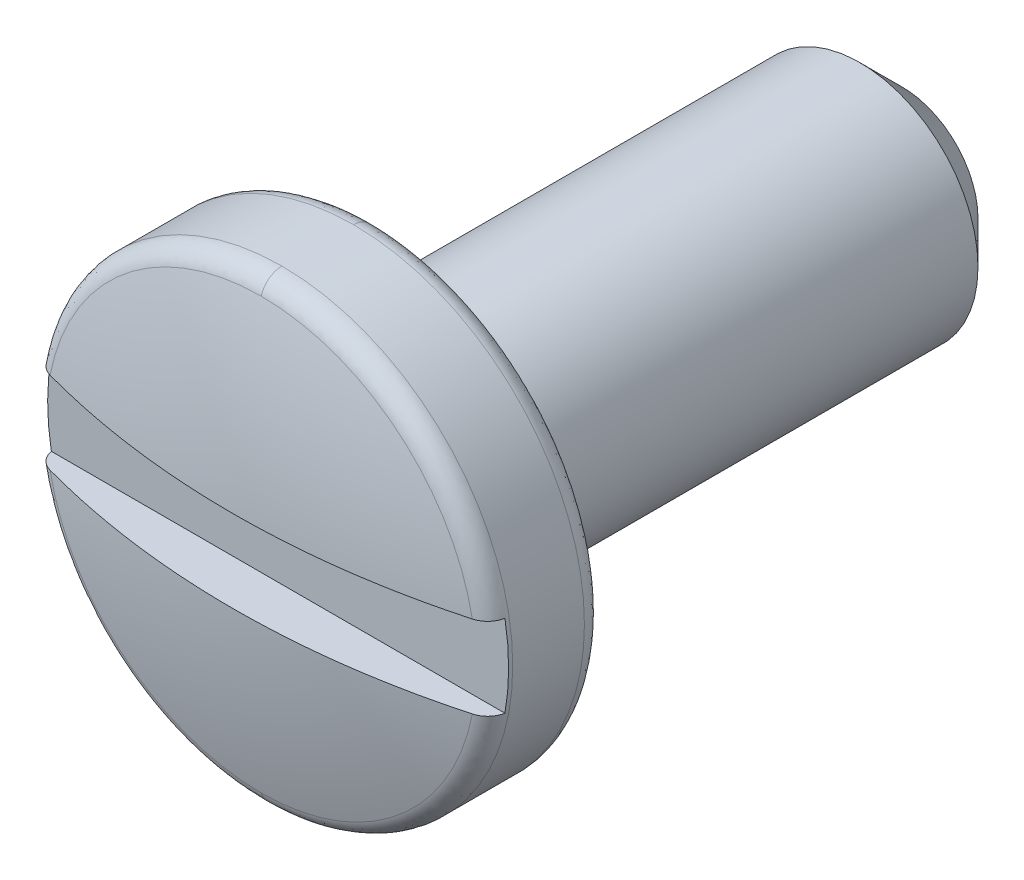
ISO-10303-21;
HEADER;
FILE_DESCRIPTION(('STEP AP214'),'2;1');
FILE_NAME('part.step','',(''),(''),'','','');
FILE_SCHEMA(('AUTOMOTIVE_DESIGN { 1 0 10303 214 1 1 1 1 }'));
ENDSEC;
DATA;
#1=APPLICATION_CONTEXT('core data for automotive mechanical design processes');
#2=APPLICATION_PROTOCOL_DEFINITION('international standard','automotive_design',2000,#1);
#3=PRODUCT_CONTEXT('',#1,'mechanical');
#4=PRODUCT('Part','Part','',(#3));
#5=PRODUCT_RELATED_PRODUCT_CATEGORY('part','',(#4));
#6=PRODUCT_DEFINITION_FORMATION('','',#4);
#7=PRODUCT_DEFINITION_CONTEXT('part definition',#1,'design');
#8=PRODUCT_DEFINITION('design','',#6,#7);
#9=PRODUCT_DEFINITION_SHAPE('','',#8);
#10=(LENGTH_UNIT() NAMED_UNIT(*) SI_UNIT(.MILLI.,.METRE.));
#11=(NAMED_UNIT(*) PLANE_ANGLE_UNIT() SI_UNIT($,.RADIAN.));
#12=(NAMED_UNIT(*) SI_UNIT($,.STERADIAN.) SOLID_ANGLE_UNIT());
#13=UNCERTAINTY_MEASURE_WITH_UNIT(LENGTH_MEASURE(1.E-05),#10,'distance_accuracy_value','');
#14=(GEOMETRIC_REPRESENTATION_CONTEXT(3) GLOBAL_UNCERTAINTY_ASSIGNED_CONTEXT((#13)) GLOBAL_UNIT_ASSIGNED_CONTEXT((#10,
#11,#12)) REPRESENTATION_CONTEXT('',''));
#15=CARTESIAN_POINT('',(0.,0.,0.));
#16=DIRECTION('',(0.,0.,1.));
#17=DIRECTION('',(1.,0.,0.));
#18=AXIS2_PLACEMENT_3D('',#15,#16,#17);
#19=CARTESIAN_POINT('',(2.810560784,-0.4953,7.5184));
#20=DIRECTION('',(0.,0.,-1.));
#21=DIRECTION('',(-1.,0.,0.));
#22=AXIS2_PLACEMENT_3D('',#19,#20,#21);
#23=PLANE('',#22);
#24=DIRECTION('',(1.,0.,0.));
#25=VECTOR('',#24,1.);
#26=CARTESIAN_POINT('',(0.,0.4953,7.5184));
#27=LINE('',#26,#25);
#28=CARTESIAN_POINT('',(-2.7327104607907,0.49530000058965,7.5184));
#29=VERTEX_POINT('',#28);
#30=CARTESIAN_POINT('',(2.73271046156647,0.495300000589655,7.5184000000816));
#31=VERTEX_POINT('',#30);
#32=EDGE_CURVE('E91',#29,#31,#27,.T.);
#33=ORIENTED_EDGE('',*,*,#32,.F.);
#34=CARTESIAN_POINT('',(-2.73271046147436,-0.4953000011793,7.5184));
#35=CARTESIAN_POINT('',(-2.74828039738149,-0.409469193814245,7.5184));
#36=CARTESIAN_POINT('',(-2.75978135809512,-0.322899123500108,7.5184));
#37=CARTESIAN_POINT('',(-2.77453736354793,-0.149786146779268,7.5184));
#38=CARTESIAN_POINT('',(-2.77786034483515,-0.0632490292027887,7.5184));
#39=CARTESIAN_POINT('',(-2.7764772397923,0.102066373689573,7.5184));
#40=CARTESIAN_POINT('',(-2.77245807880627,0.180851109326066,7.5184));
#41=CARTESIAN_POINT('',(-2.75768636332443,0.33839564789017,7.5184));
#42=CARTESIAN_POINT('',(-2.74688248153751,0.417150639801147,7.5184));
#43=CARTESIAN_POINT('',(-2.73271046147437,0.495300001179283,7.5184));
#44=B_SPLINE_CURVE_WITH_KNOTS('',3,(#34,#35,#36,#37,#38,#39,#40,#41,#42,#43),.UNSPECIFIED.,.F.,
.F.,(4,2,2,2,4),(0.,0.261601847042544,0.52102305314427,0.757402518901725,0.995592131386147),.UNSPECIFIED.);
#45=CARTESIAN_POINT('',(-2.73271046156637,-0.49530000058965,7.51840000008158));
#46=VERTEX_POINT('',#45);
#47=EDGE_CURVE('E21',#46,#29,#44,.T.);
#48=ORIENTED_EDGE('',*,*,#47,.F.);
#49=DIRECTION('',(1.,0.,0.));
#50=VECTOR('',#49,1.);
#51=CARTESIAN_POINT('',(0.,-0.4953,7.5184));
#52=LINE('',#51,#50);
#53=CARTESIAN_POINT('',(2.73271046079075,-0.495300000589654,7.5184));
#54=VERTEX_POINT('',#53);
#55=EDGE_CURVE('E88',#46,#54,#52,.T.);
#56=ORIENTED_EDGE('',*,*,#55,.T.);
#57=CARTESIAN_POINT('',(2.73271046147447,0.495300001179309,7.5184));
#58=CARTESIAN_POINT('',(2.74828039738158,0.409469193814328,7.5184));
#59=CARTESIAN_POINT('',(2.7597813580952,0.322899123500266,7.5184));
#60=CARTESIAN_POINT('',(2.77453736354801,0.149786146779574,7.5184));
#61=CARTESIAN_POINT('',(2.77786034483524,0.0632490292031695,7.5184));
#62=CARTESIAN_POINT('',(2.77647723979242,-0.102066373689196,7.5184));
#63=CARTESIAN_POINT('',(2.7724580788064,-0.180851109325765,7.5184));
#64=CARTESIAN_POINT('',(2.75768636332455,-0.338395647890023,7.5184));
#65=CARTESIAN_POINT('',(2.74688248153763,-0.417150639801077,7.5184));
#66=CARTESIAN_POINT('',(2.73271046147447,-0.495300001179289,7.5184));
#67=B_SPLINE_CURVE_WITH_KNOTS('',3,(#57,#58,#59,#60,#61,#62,#63,#64,#65,#66),.UNSPECIFIED.,.F.,
.F.,(4,2,2,2,4),(0.,0.26160184704232,0.521023053143826,0.75740251890151,0.995592131386164),.UNSPECIFIED.);
#68=EDGE_CURVE('E95',#31,#54,#67,.T.);
#69=ORIENTED_EDGE('',*,*,#68,.F.);
#70=EDGE_LOOP('',(#33,#48,#56,#69));
#71=FACE_BOUND('',#70,.T.);
#72=ADVANCED_FACE('F17',(#71),#23,.F.);
#73=CARTESIAN_POINT('',(-2.765502987,0.4953,8.067743499));
#74=DIRECTION('',(0.,-1.,0.));
#75=DIRECTION('',(0.,0.,-1.));
#76=AXIS2_PLACEMENT_3D('',#73,#74,#75);
#77=PLANE('',#76);
#78=CARTESIAN_POINT('',(2.54411463049598,0.495300000000001,7.72221946969442));
#79=CARTESIAN_POINT('',(2.38794465377172,0.4953,7.76500940889019));
#80=CARTESIAN_POINT('',(2.23073129428016,0.4953,7.8038518760534));
#81=CARTESIAN_POINT('',(1.91452513292982,0.4953,7.87356645356393));
#82=CARTESIAN_POINT('',(1.75553209490895,0.4953,7.90443749270651));
#83=CARTESIAN_POINT('',(1.27714558573034,0.4953,7.98484068113248));
#84=CARTESIAN_POINT('',(0.955620319666148,0.495299999999999,8.02236120740954));
#85=CARTESIAN_POINT('',(0.422392629440619,0.4953,8.05752080910745));
#86=CARTESIAN_POINT('',(0.211223377636595,0.495300000000001,8.06447200956291));
#87=CARTESIAN_POINT('',(-0.330870196853922,0.495300000000002,8.06445940019809));
#88=CARTESIAN_POINT('',(-0.661873205640471,0.4953,8.04738310015066));
#89=CARTESIAN_POINT('',(-1.25325672102805,0.4953,7.98618624492563));
#90=CARTESIAN_POINT('',(-1.51430947451612,0.495300000000001,7.9482720401804));
#91=CARTESIAN_POINT('',(-2.03255482278499,0.495299999999999,7.85115163707558));
#92=CARTESIAN_POINT('',(-2.28974548156422,0.495299999999995,7.79193510852097));
#93=CARTESIAN_POINT('',(-2.54411463051288,0.495299999999986,7.72221946968979));
#94=B_SPLINE_CURVE_WITH_KNOTS('',3,(#78,#79,#80,#81,#82,#83,#84,#85,#86,#87,#88,#89,#90,#91,#92,
#93),.UNSPECIFIED.,.F.,.F.,(4,2,2,2,2,2,2,4),(0.,0.4856528944164,0.971371017203071,
1.94056402991978,2.57407118722789,3.56642648326778,4.35696369520601,5.14788478246958),.UNSPECIFIED.);
#95=CARTESIAN_POINT('',(2.54411463043927,0.4953,7.72221946948743));
#96=VERTEX_POINT('',#95);
#97=CARTESIAN_POINT('',(-2.54411463045616,0.4953,7.72221946948279));
#98=VERTEX_POINT('',#97);
#99=EDGE_CURVE('E104',#96,#98,#94,.T.);
#100=ORIENTED_EDGE('',*,*,#99,.T.);
#101=CARTESIAN_POINT('',(-2.54411463039944,0.4953,7.72221946927579));
#102=CARTESIAN_POINT('',(-2.55846005006124,0.4953,7.71830134658374));
#103=CARTESIAN_POINT('',(-2.57247164028389,0.4953,7.71316465300917));
#104=CARTESIAN_POINT('',(-2.59944120560283,0.4953,7.70063315717405));
#105=CARTESIAN_POINT('',(-2.61239945975989,0.4953,7.69323895548122));
#106=CARTESIAN_POINT('',(-2.63689386116712,0.4953,7.67636270637496));
#107=CARTESIAN_POINT('',(-2.64842890508144,0.4953,7.66687905479635));
#108=CARTESIAN_POINT('',(-2.6697183011493,0.4953,7.64608679453386));
#109=CARTESIAN_POINT('',(-2.67947267370479,0.4953,7.63477820676189));
#110=CARTESIAN_POINT('',(-2.69679394856132,0.4953,7.61079923256062));
#111=CARTESIAN_POINT('',(-2.70438542305095,0.4953,7.59814658842275));
#112=CARTESIAN_POINT('',(-2.71728589142903,0.4953,7.57174530468987));
#113=CARTESIAN_POINT('',(-2.72259840676833,0.495300000000001,7.55799839521272));
#114=CARTESIAN_POINT('',(-2.72913799598742,0.4953,7.53551215966269));
#115=CARTESIAN_POINT('',(-2.73114846187448,0.4953,7.52699462461382));
#116=CARTESIAN_POINT('',(-2.73271046165838,0.495299999999998,7.51840000016316));
#117=B_SPLINE_CURVE_WITH_KNOTS('',3,(#101,#102,#103,#104,#105,#106,#107,#108,#109,#110,#111,
#112,#113,#114,#115,#116),.UNSPECIFIED.,.F.,.F.,(4,2,2,2,2,2,2,4),(0.,0.0445604174619402,
0.0891089907742483,0.133691885968132,0.178274270323827,0.22232788851279,0.266313187623364,
0.292520215221391),.UNSPECIFIED.);
#118=EDGE_CURVE('E108',#98,#29,#117,.T.);
#119=ORIENTED_EDGE('',*,*,#118,.T.);
#120=ORIENTED_EDGE('',*,*,#32,.T.);
#121=CARTESIAN_POINT('',(2.73271046165848,0.495299999999999,7.5184000001632));
#122=CARTESIAN_POINT('',(2.73012837340707,0.4953,7.53264476791162));
#123=CARTESIAN_POINT('',(2.7263108760782,0.4953,7.54665824634603));
#124=CARTESIAN_POINT('',(2.71638537810155,0.4953,7.57382645111726));
#125=CARTESIAN_POINT('',(2.71028079045998,0.4953,7.58698242293057));
#126=CARTESIAN_POINT('',(2.69595171303076,0.4953,7.61208578013849));
#127=CARTESIAN_POINT('',(2.68772692579947,0.4953,7.62403299562846));
#128=CARTESIAN_POINT('',(2.66940451524846,0.4953,7.646396950934));
#129=CARTESIAN_POINT('',(2.65930633096635,0.4953,7.65681323065364));
#130=CARTESIAN_POINT('',(2.63743133632214,0.4953,7.67592556176216));
#131=CARTESIAN_POINT('',(2.6256399095886,0.4953,7.68460486990449));
#132=CARTESIAN_POINT('',(2.60078117674321,0.495300000000001,7.69989980338631));
#133=CARTESIAN_POINT('',(2.58771348634899,0.495300000000002,7.70651480463317));
#134=CARTESIAN_POINT('',(2.56438236166701,0.495299999999997,7.71601502242213));
#135=CARTESIAN_POINT('',(2.55433017336382,0.495299999999992,7.71942553630915));
#136=CARTESIAN_POINT('',(2.54411463038262,0.495299999999984,7.72221946928042));
#137=B_SPLINE_CURVE_WITH_KNOTS('',3,(#121,#122,#123,#124,#125,#126,#127,#128,#129,#130,#131,
#132,#133,#134,#135,#136),.UNSPECIFIED.,.F.,.F.,(4,2,2,2,2,2,2,4),(0.,0.043368355398323,
0.0866722486804428,0.129982220391855,0.173305181658074,0.217027518780744,0.260763061504352,
0.292529713830521),.UNSPECIFIED.);
#138=EDGE_CURVE('E111',#31,#96,#137,.T.);
#139=ORIENTED_EDGE('',*,*,#138,.T.);
#140=EDGE_LOOP('',(#100,#119,#120,#139));
#141=FACE_BOUND('',#140,.T.);
#142=ADVANCED_FACE('F288',(#141),#77,.T.);
#143=CARTESIAN_POINT('',(-2.765502987,-0.4953,8.067743499));
#144=DIRECTION('',(0.,-1.,0.));
#145=DIRECTION('',(0.,0.,-1.));
#146=AXIS2_PLACEMENT_3D('',#143,#144,#145);
#147=PLANE('',#146);
#148=CARTESIAN_POINT('',(-2.54411463042029,-0.495300000000001,7.72221946927007));
#149=CARTESIAN_POINT('',(-2.55846005008172,-0.495300000000001,7.71830134657689));
#150=CARTESIAN_POINT('',(-2.57247164030389,-0.4953,7.7131646530012));
#151=CARTESIAN_POINT('',(-2.59944120562171,-0.4953,7.70063315716395));
#152=CARTESIAN_POINT('',(-2.61239945977813,-0.4953,7.6932389554701));
#153=CARTESIAN_POINT('',(-2.6368938611839,-0.4953,7.67636270636194));
#154=CARTESIAN_POINT('',(-2.6484289050974,-0.4953,7.66687905478244));
#155=CARTESIAN_POINT('',(-2.6697183011635,-0.4953,7.64608679451832));
#156=CARTESIAN_POINT('',(-2.67947267371804,-0.495299999999999,7.6347782067456));
#157=CARTESIAN_POINT('',(-2.69679394857257,-0.495299999999999,7.61079923254302));
#158=CARTESIAN_POINT('',(-2.70438542306115,-0.4953,7.59814658840459));
#159=CARTESIAN_POINT('',(-2.71728589143705,-0.4953,7.57174530467077));
#160=CARTESIAN_POINT('',(-2.72259840677522,-0.4953,7.55799839519325));
#161=CARTESIAN_POINT('',(-2.72913799599056,-0.495299999999999,7.53551215964934));
#162=CARTESIAN_POINT('',(-2.7311484618757,-0.495299999999999,7.52699462460708));
#163=CARTESIAN_POINT('',(-2.73271046165838,-0.495299999999998,7.51840000016316));
#164=B_SPLINE_CURVE_WITH_KNOTS('',3,(#148,#149,#150,#151,#152,#153,#154,#155,#156,#157,#158,
#159,#160,#161,#162,#163),.UNSPECIFIED.,.F.,.F.,(4,2,2,2,2,2,2,4),(0.,0.0445604174617692,
0.0891089907738942,0.133691885967594,0.178274270323118,0.222327888511919,0.266313187622293,
0.292520215199805),.UNSPECIFIED.);
#165=CARTESIAN_POINT('',(-2.54411463047701,-0.495300000000001,7.72221946947708));
#166=VERTEX_POINT('',#165);
#167=EDGE_CURVE('E98',#166,#46,#164,.T.);
#168=ORIENTED_EDGE('',*,*,#167,.F.);
#169=CARTESIAN_POINT('',(-2.54411463053373,-0.4953,7.72221946968408));
#170=CARTESIAN_POINT('',(-2.38794465380966,-0.4953,7.76500940888048));
#171=CARTESIAN_POINT('',(-2.23073129431828,-0.4953,7.80385187604432));
#172=CARTESIAN_POINT('',(-1.91452513296827,-0.4953,7.87356645355612));
#173=CARTESIAN_POINT('',(-1.75553209494756,-0.4953,7.90443749269935));
#174=CARTESIAN_POINT('',(-1.27714558576927,-0.4953,7.98484068112727));
#175=CARTESIAN_POINT('',(-0.955620319705201,-0.495300000000001,8.02236120740565));
#176=CARTESIAN_POINT('',(-0.422392629414326,-0.495300000000002,8.05752080911004));
#177=CARTESIAN_POINT('',(-0.211223377544655,-0.495300000000003,8.06447200956636));
#178=CARTESIAN_POINT('',(0.330870197011442,-0.495300000000001,8.06445940019268));
#179=CARTESIAN_POINT('',(0.661873205797693,-0.495299999999997,8.04738310013983));
#180=CARTESIAN_POINT('',(1.25325672116466,-0.495299999999999,7.98618624490716));
#181=CARTESIAN_POINT('',(1.5143094746327,-0.495300000000002,7.9482720401613));
#182=CARTESIAN_POINT('',(2.03255482286184,-0.495299999999998,7.85115163705844));
#183=CARTESIAN_POINT('',(2.28974548162138,-0.495299999999992,7.79193510850642));
#184=CARTESIAN_POINT('',(2.54411463055073,-0.495299999999973,7.72221946967942));
#185=B_SPLINE_CURVE_WITH_KNOTS('',3,(#169,#170,#171,#172,#173,#174,#175,#176,#177,#178,#179,
#180,#181,#182,#183,#184),.UNSPECIFIED.,.F.,.F.,(4,2,2,2,2,2,2,4),(0.,0.485652894416339,
0.971371017202913,1.94056402991978,2.57407118742441,3.5664264834643,4.35696369534351,
5.14788478254795),.UNSPECIFIED.);
#186=CARTESIAN_POINT('',(2.54411463049401,-0.495299999999992,7.72221946947243));
#187=VERTEX_POINT('',#186);
#188=EDGE_CURVE('E156',#166,#187,#185,.T.);
#189=ORIENTED_EDGE('',*,*,#188,.T.);
#190=CARTESIAN_POINT('',(2.73271046165848,-0.4953,7.5184000001632));
#191=CARTESIAN_POINT('',(2.73012837340707,-0.4953,7.53264476791163));
#192=CARTESIAN_POINT('',(2.72631087607819,-0.4953,7.54665824634604));
#193=CARTESIAN_POINT('',(2.71638537810154,-0.4953,7.57382645111726));
#194=CARTESIAN_POINT('',(2.71028079045998,-0.4953,7.58698242293058));
#195=CARTESIAN_POINT('',(2.69595171303076,-0.4953,7.61208578013848));
#196=CARTESIAN_POINT('',(2.68772692579948,-0.4953,7.62403299562845));
#197=CARTESIAN_POINT('',(2.66940451524846,-0.4953,7.64639695093399));
#198=CARTESIAN_POINT('',(2.65930633096635,-0.495299999999999,7.65681323065364));
#199=CARTESIAN_POINT('',(2.63743133632212,-0.495299999999999,7.67592556176217));
#200=CARTESIAN_POINT('',(2.62563990958857,-0.495299999999999,7.68460486990451));
#201=CARTESIAN_POINT('',(2.60078117674318,-0.495300000000001,7.69989980338633));
#202=CARTESIAN_POINT('',(2.58771348634896,-0.495300000000002,7.70651480463319));
#203=CARTESIAN_POINT('',(2.56438236168453,-0.495299999999996,7.716015022415));
#204=CARTESIAN_POINT('',(2.55433017339972,-0.495299999999991,7.71942553629696));
#205=CARTESIAN_POINT('',(2.54411463043736,-0.495299999999982,7.72221946926542));
#206=B_SPLINE_CURVE_WITH_KNOTS('',3,(#190,#191,#192,#193,#194,#195,#196,#197,#198,#199,#200,
#201,#202,#203,#204,#205),.UNSPECIFIED.,.F.,.F.,(4,2,2,2,2,2,2,4),(0.,0.0433683553983379,
0.0866722486804451,0.129982220391839,0.173305181658073,0.217027518780799,0.260763061504353,
0.292529713773856),.UNSPECIFIED.);
#207=EDGE_CURVE('E105',#54,#187,#206,.T.);
#208=ORIENTED_EDGE('',*,*,#207,.F.);
#209=ORIENTED_EDGE('',*,*,#55,.F.);
#210=EDGE_LOOP('',(#168,#189,#208,#209));
#211=FACE_BOUND('',#210,.T.);
#212=ADVANCED_FACE('F107',(#211),#147,.F.);
#213=CARTESIAN_POINT('',(-4.71259919976319E-10,0.,-1.56255757352997));
#214=DIRECTION('',(0.,0.,1.));
#215=DIRECTION('',(0.,-1.,0.));
#216=AXIS2_PLACEMENT_3D('',#213,#214,#215);
#217=SPHERICAL_SURFACE('',#216,9.639757574);
#218=CARTESIAN_POINT('',(0.,0.,7.72221947442706));
#219=DIRECTION('',(0.,0.,-1.));
#220=DIRECTION('',(-1.,0.,0.));
#221=AXIS2_PLACEMENT_3D('',#218,#219,#220);
#222=CIRCLE('',#221,2.59187986745555);
#223=CARTESIAN_POINT('',(-1.41096817751618E-12,2.59187990396491,7.72221946434168));
#224=VERTEX_POINT('',#223);
#225=EDGE_CURVE('E185',#224,#96,#222,.T.);
#226=ORIENTED_EDGE('',*,*,#225,.F.);
#227=CARTESIAN_POINT('',(0.,0.,7.72221947442707));
#228=DIRECTION('',(0.,0.,-1.));
#229=DIRECTION('',(-1.,0.,0.));
#230=AXIS2_PLACEMENT_3D('',#227,#228,#229);
#231=CIRCLE('',#230,2.59187986745551);
#232=EDGE_CURVE('E186',#98,#224,#231,.T.);
#233=ORIENTED_EDGE('',*,*,#232,.F.);
#234=ORIENTED_EDGE('',*,*,#99,.F.);
#235=EDGE_LOOP('',(#226,#233,#234));
#236=FACE_BOUND('',#235,.T.);
#237=ADVANCED_FACE('F170',(#236),#217,.T.);
#238=CARTESIAN_POINT('',(-4.71259919976319E-10,0.,-1.56255757352997));
#239=DIRECTION('',(0.,0.,1.));
#240=DIRECTION('',(0.,-1.,0.));
#241=AXIS2_PLACEMENT_3D('',#238,#239,#240);
#242=SPHERICAL_SURFACE('',#241,9.639757574);
#243=CARTESIAN_POINT('',(0.,0.,7.72221947442706));
#244=DIRECTION('',(0.,0.,-1.));
#245=DIRECTION('',(-1.,0.,0.));
#246=AXIS2_PLACEMENT_3D('',#243,#244,#245);
#247=CIRCLE('',#246,2.59187986745555);
#248=CARTESIAN_POINT('',(3.83579854970878E-10,-2.5918798918043,7.72221946773636));
#249=VERTEX_POINT('',#248);
#250=EDGE_CURVE('E190',#187,#249,#247,.T.);
#251=ORIENTED_EDGE('',*,*,#250,.F.);
#252=ORIENTED_EDGE('',*,*,#188,.F.);
#253=CARTESIAN_POINT('',(0.,0.,7.72221947442707));
#254=DIRECTION('',(0.,0.,-1.));
#255=DIRECTION('',(-1.,0.,0.));
#256=AXIS2_PLACEMENT_3D('',#253,#254,#255);
#257=CIRCLE('',#256,2.59187986745551);
#258=EDGE_CURVE('E101',#249,#166,#257,.T.);
#259=ORIENTED_EDGE('',*,*,#258,.F.);
#260=EDGE_LOOP('',(#251,#252,#259));
#261=FACE_BOUND('',#260,.T.);
#262=ADVANCED_FACE('F166',(#261),#242,.T.);
#263=CARTESIAN_POINT('',(0.,2.56661948,7.727927199));
#264=CARTESIAN_POINT('',(-5.13323896,2.56661948,7.727927199));
#265=CARTESIAN_POINT('',(-5.13323896,-2.56661948,7.727927199));
#266=CARTESIAN_POINT('',(0.,-2.56661948,7.727927199));
#267=CARTESIAN_POINT('',(0.,2.707713903,7.70338425));
#268=CARTESIAN_POINT('',(-5.415427805,2.707713903,7.70338425));
#269=CARTESIAN_POINT('',(-5.415427805,-2.707713903,7.70338425));
#270=CARTESIAN_POINT('',(0.,-2.707713903,7.70338425));
#271=CARTESIAN_POINT('',(0.,2.794303132,7.589312791));
#272=CARTESIAN_POINT('',(-5.588606265,2.794303132,7.589312791));
#273=CARTESIAN_POINT('',(-5.588606265,-2.794303132,7.589312791));
#274=CARTESIAN_POINT('',(0.,-2.794303132,7.589312791));
#275=CARTESIAN_POINT('',(0.,2.780005679,7.446815158));
#276=CARTESIAN_POINT('',(-5.560011358,2.780005679,7.446815158));
#277=CARTESIAN_POINT('',(-5.560011358,-2.780005679,7.446815158));
#278=CARTESIAN_POINT('',(0.,-2.780005679,7.446815158));
#279=(BOUNDED_SURFACE() B_SPLINE_SURFACE(3,3,((#263,#264,#265,#266),(#267,#268,#269,#270),(#271,
#272,#273,#274),(#275,#276,#277,#278)),.UNSPECIFIED.,.F.,.F.,
.F.) B_SPLINE_SURFACE_WITH_KNOTS((4,4),(4,4),(0.,1.),(0.,1.),
.UNSPECIFIED.) GEOMETRIC_REPRESENTATION_ITEM() RATIONAL_B_SPLINE_SURFACE(((1.,0.333333333333311,
0.333333333333311,1.),(0.821450118929236,0.273816706309727,0.273816706309727,0.821450118929236),
(0.821450118929236,0.273816706309727,0.273816706309727,0.821450118929236),(1.,0.333333333333311,
0.333333333333311,1.))) REPRESENTATION_ITEM('') SURFACE());
#280=CARTESIAN_POINT('',(0.,2.56661948,7.727927199));
#281=CARTESIAN_POINT('',(0.,2.707713903,7.70338425));
#282=CARTESIAN_POINT('',(0.,2.794303132,7.589312791));
#283=CARTESIAN_POINT('',(0.,2.780005679,7.446815158));
#284=(BOUNDED_CURVE() B_SPLINE_CURVE(3,(#280,#281,#282,#283),.UNSPECIFIED.,.F.,
.F.) B_SPLINE_CURVE_WITH_KNOTS((4,4),(0.,1.),
.UNSPECIFIED.) CURVE() GEOMETRIC_REPRESENTATION_ITEM() RATIONAL_B_SPLINE_CURVE((1.,
0.821450118930907,0.821450118930907,1.)) REPRESENTATION_ITEM(''));
#285=CARTESIAN_POINT('',(1.42613460108871E-10,2.7812999999429,7.47267999989162));
#286=VERTEX_POINT('',#285);
#287=EDGE_CURVE('E183',#286,#224,#284,.F.);
#288=CARTESIAN_POINT('',(0.,0.,7.47268));
#289=DIRECTION('',(0.,0.,-1.));
#290=DIRECTION('',(-1.,0.,0.));
#291=AXIS2_PLACEMENT_3D('',#288,#289,#290);
#292=CIRCLE('',#291,2.7813);
#293=CARTESIAN_POINT('',(7.13291983348944E-10,-2.7812999999429,7.47268));
#294=VERTEX_POINT('',#293);
#295=EDGE_CURVE('E207',#286,#294,#292,.F.);
#296=CARTESIAN_POINT('',(0.,-2.56661948,7.727927199));
#297=CARTESIAN_POINT('',(0.,-2.707713903,7.70338425));
#298=CARTESIAN_POINT('',(0.,-2.794303132,7.589312791));
#299=CARTESIAN_POINT('',(0.,-2.780005679,7.446815158));
#300=(BOUNDED_CURVE() B_SPLINE_CURVE(3,(#296,#297,#298,#299),.UNSPECIFIED.,.F.,
.F.) B_SPLINE_CURVE_WITH_KNOTS((4,4),(0.,1.),
.UNSPECIFIED.) CURVE() GEOMETRIC_REPRESENTATION_ITEM() RATIONAL_B_SPLINE_CURVE((1.,
0.821450118930907,0.821450118930907,1.)) REPRESENTATION_ITEM(''));
#301=EDGE_CURVE('E204',#249,#294,#300,.T.);
#302=ORIENTED_EDGE('',*,*,#118,.F.);
#303=ORIENTED_EDGE('',*,*,#232,.T.);
#304=ORIENTED_EDGE('',*,*,#287,.F.);
#305=ORIENTED_EDGE('',*,*,#295,.T.);
#306=ORIENTED_EDGE('',*,*,#301,.F.);
#307=ORIENTED_EDGE('',*,*,#258,.T.);
#308=ORIENTED_EDGE('',*,*,#167,.T.);
#309=ORIENTED_EDGE('',*,*,#47,.T.);
#310=EDGE_LOOP('',(#302,#303,#304,#305,#306,#307,#308,#309));
#311=FACE_BOUND('',#310,.T.);
#312=ADVANCED_FACE('F99',(#311),#279,.T.);
#313=CARTESIAN_POINT('',(0.,-2.56661948,7.727927199));
#314=CARTESIAN_POINT('',(5.13323896,-2.56661948,7.727927199));
#315=CARTESIAN_POINT('',(5.13323896,2.56661948,7.727927199));
#316=CARTESIAN_POINT('',(0.,2.56661948,7.727927199));
#317=CARTESIAN_POINT('',(0.,-2.707713903,7.70338425));
#318=CARTESIAN_POINT('',(5.415427805,-2.707713903,7.70338425));
#319=CARTESIAN_POINT('',(5.415427805,2.707713903,7.70338425));
#320=CARTESIAN_POINT('',(0.,2.707713903,7.70338425));
#321=CARTESIAN_POINT('',(0.,-2.794303132,7.589312791));
#322=CARTESIAN_POINT('',(5.588606265,-2.794303132,7.589312791));
#323=CARTESIAN_POINT('',(5.588606265,2.794303132,7.589312791));
#324=CARTESIAN_POINT('',(0.,2.794303132,7.589312791));
#325=CARTESIAN_POINT('',(0.,-2.780005679,7.446815158));
#326=CARTESIAN_POINT('',(5.560011358,-2.780005679,7.446815158));
#327=CARTESIAN_POINT('',(5.560011358,2.780005679,7.446815158));
#328=CARTESIAN_POINT('',(0.,2.780005679,7.446815158));
#329=(BOUNDED_SURFACE() B_SPLINE_SURFACE(3,3,((#313,#314,#315,#316),(#317,#318,#319,#320),(#321,
#322,#323,#324),(#325,#326,#327,#328)),.UNSPECIFIED.,.F.,.F.,
.F.) B_SPLINE_SURFACE_WITH_KNOTS((4,4),(4,4),(0.,1.),(0.,1.),
.UNSPECIFIED.) GEOMETRIC_REPRESENTATION_ITEM() RATIONAL_B_SPLINE_SURFACE(((1.,0.333333333333333,
0.333333333333333,1.),(0.821450118930907,0.273816706310302,0.273816706310302,0.821450118930907),
(0.821450118930907,0.273816706310302,0.273816706310302,0.821450118930907),(1.,0.333333333333333,
0.333333333333333,1.))) REPRESENTATION_ITEM('') SURFACE());
#330=CARTESIAN_POINT('',(0.,0.,7.47268));
#331=DIRECTION('',(0.,0.,-1.));
#332=DIRECTION('',(-1.,0.,0.));
#333=AXIS2_PLACEMENT_3D('',#330,#331,#332);
#334=CIRCLE('',#333,2.7813);
#335=EDGE_CURVE('E214',#294,#286,#334,.F.);
#336=ORIENTED_EDGE('',*,*,#301,.T.);
#337=ORIENTED_EDGE('',*,*,#335,.T.);
#338=ORIENTED_EDGE('',*,*,#287,.T.);
#339=ORIENTED_EDGE('',*,*,#225,.T.);
#340=ORIENTED_EDGE('',*,*,#138,.F.);
#341=ORIENTED_EDGE('',*,*,#68,.T.);
#342=ORIENTED_EDGE('',*,*,#207,.T.);
#343=ORIENTED_EDGE('',*,*,#250,.T.);
#344=EDGE_LOOP('',(#336,#337,#338,#339,#340,#341,#342,#343));
#345=FACE_BOUND('',#344,.T.);
#346=ADVANCED_FACE('F262',(#345),#329,.T.);
#347=CARTESIAN_POINT('',(0.,0.,7.47268));
#348=DIRECTION('',(0.,0.,-1.));
#349=DIRECTION('',(0.,1.,0.));
#350=AXIS2_PLACEMENT_3D('',#347,#348,#349);
#351=CYLINDRICAL_SURFACE('',#350,2.7813);
#352=CARTESIAN_POINT('',(0.,0.,6.60908000030267));
#353=DIRECTION('',(0.,0.,-1.));
#354=DIRECTION('',(-1.,0.,0.));
#355=AXIS2_PLACEMENT_3D('',#352,#353,#354);
#356=CIRCLE('',#355,2.78129999985925);
#357=CARTESIAN_POINT('',(0.,-2.78129999985925,6.60908000030267));
#358=VERTEX_POINT('',#357);
#359=CARTESIAN_POINT('',(0.,2.78129999985925,6.60908000030267));
#360=VERTEX_POINT('',#359);
#361=EDGE_CURVE('E229',#358,#360,#356,.T.);
#362=ORIENTED_EDGE('',*,*,#361,.F.);
#363=CARTESIAN_POINT('',(0.,0.,6.60908000030267));
#364=DIRECTION('',(0.,0.,-1.));
#365=DIRECTION('',(-1.,0.,0.));
#366=AXIS2_PLACEMENT_3D('',#363,#364,#365);
#367=CIRCLE('',#366,2.78129999985925);
#368=EDGE_CURVE('E217',#360,#358,#367,.T.);
#369=ORIENTED_EDGE('',*,*,#368,.F.);
#370=EDGE_LOOP('',(#362,#369));
#371=FACE_BOUND('',#370,.T.);
#372=ORIENTED_EDGE('',*,*,#335,.F.);
#373=ORIENTED_EDGE('',*,*,#295,.F.);
#374=EDGE_LOOP('',(#372,#373));
#375=FACE_BOUND('',#374,.T.);
#376=ADVANCED_FACE('F251',(#371,#375),#351,.T.);
#377=CARTESIAN_POINT('',(0.,-2.780005679,6.634944842));
#378=CARTESIAN_POINT('',(5.560011358,-2.780005679,6.634944842));
#379=CARTESIAN_POINT('',(5.560011358,2.780005679,6.634944842));
#380=CARTESIAN_POINT('',(0.,2.780005679,6.634944842));
#381=CARTESIAN_POINT('',(0.,-2.797679147,6.458799671));
#382=CARTESIAN_POINT('',(5.595358294,-2.797679147,6.458799671));
#383=CARTESIAN_POINT('',(5.595358294,2.797679147,6.458799671));
#384=CARTESIAN_POINT('',(0.,2.797679147,6.458799671));
#385=CARTESIAN_POINT('',(0.,-2.672500329,6.333620853));
#386=CARTESIAN_POINT('',(5.345000659,-2.672500329,6.333620853));
#387=CARTESIAN_POINT('',(5.345000659,2.672500329,6.333620853));
#388=CARTESIAN_POINT('',(0.,2.672500329,6.333620853));
#389=CARTESIAN_POINT('',(0.,-2.496355158,6.351294321));
#390=CARTESIAN_POINT('',(4.992710317,-2.496355158,6.351294321));
#391=CARTESIAN_POINT('',(4.992710317,2.496355158,6.351294321));
#392=CARTESIAN_POINT('',(0.,2.496355158,6.351294321));
#393=(BOUNDED_SURFACE() B_SPLINE_SURFACE(3,3,((#377,#378,#379,#380),(#381,#382,#383,#384),(#385,
#386,#387,#388),(#389,#390,#391,#392)),.UNSPECIFIED.,.F.,.F.,
.F.) B_SPLINE_SURFACE_WITH_KNOTS((4,4),(4,4),(0.,1.),(0.,1.),
.UNSPECIFIED.) GEOMETRIC_REPRESENTATION_ITEM() RATIONAL_B_SPLINE_SURFACE(((1.,0.333333333333333,
0.333333333333333,1.),(0.755320871117895,0.251773623705965,0.251773623705965,0.755320871117895),
(0.755320871117895,0.251773623705965,0.251773623705965,0.755320871117895),(1.,0.333333333333333,
0.333333333333333,1.))) REPRESENTATION_ITEM('') SURFACE());
#394=CARTESIAN_POINT('',(0.,-2.780005679,6.634944842));
#395=CARTESIAN_POINT('',(0.,-2.797679147,6.458799671));
#396=CARTESIAN_POINT('',(0.,-2.672500329,6.333620853));
#397=CARTESIAN_POINT('',(0.,-2.496355158,6.351294321));
#398=(BOUNDED_CURVE() B_SPLINE_CURVE(3,(#394,#395,#396,#397),.UNSPECIFIED.,.F.,
.F.) B_SPLINE_CURVE_WITH_KNOTS((4,4),(0.,1.),
.UNSPECIFIED.) CURVE() GEOMETRIC_REPRESENTATION_ITEM() RATIONAL_B_SPLINE_CURVE((1.,
0.755320871118012,0.755320871118012,1.)) REPRESENTATION_ITEM(''));
#399=CARTESIAN_POINT('',(0.,-2.52221999921823,6.35000000008445));
#400=VERTEX_POINT('',#399);
#401=EDGE_CURVE('E41',#400,#358,#398,.F.);
#402=CARTESIAN_POINT('',(0.,-2.52221999944793,6.35000000014075));
#403=CARTESIAN_POINT('',(5.04443999988676,-2.52221999944793,6.35000000014075));
#404=CARTESIAN_POINT('',(5.04443999988676,2.52221999944793,6.35000000014075));
#405=CARTESIAN_POINT('',(0.,2.52221999944793,6.35000000014075));
#406=(BOUNDED_CURVE() B_SPLINE_CURVE(3,(#402,#403,#404,#405),.UNSPECIFIED.,.F.,
.F.) B_SPLINE_CURVE_WITH_KNOTS((4,4),(0.,1.),
.UNSPECIFIED.) CURVE() GEOMETRIC_REPRESENTATION_ITEM() RATIONAL_B_SPLINE_CURVE((0.956578302547393,
0.318859434182464,0.318859434182464,0.956578302547393)) REPRESENTATION_ITEM(''));
#407=CARTESIAN_POINT('',(0.,2.52221999921823,6.35000000008445));
#408=VERTEX_POINT('',#407);
#409=EDGE_CURVE('E124',#408,#400,#406,.F.);
#410=CARTESIAN_POINT('',(0.,2.780005679,6.634944842));
#411=CARTESIAN_POINT('',(0.,2.797679147,6.458799671));
#412=CARTESIAN_POINT('',(0.,2.672500329,6.333620853));
#413=CARTESIAN_POINT('',(0.,2.496355158,6.351294321));
#414=(BOUNDED_CURVE() B_SPLINE_CURVE(3,(#410,#411,#412,#413),.UNSPECIFIED.,.F.,
.F.) B_SPLINE_CURVE_WITH_KNOTS((4,4),(0.,1.),
.UNSPECIFIED.) CURVE() GEOMETRIC_REPRESENTATION_ITEM() RATIONAL_B_SPLINE_CURVE((1.,
0.755320871118012,0.755320871118012,1.)) REPRESENTATION_ITEM(''));
#415=EDGE_CURVE('E218',#360,#408,#414,.T.);
#416=ORIENTED_EDGE('',*,*,#368,.T.);
#417=ORIENTED_EDGE('',*,*,#401,.F.);
#418=ORIENTED_EDGE('',*,*,#409,.F.);
#419=ORIENTED_EDGE('',*,*,#415,.F.);
#420=EDGE_LOOP('',(#416,#417,#418,#419));
#421=FACE_BOUND('',#420,.T.);
#422=ADVANCED_FACE('F239',(#421),#393,.T.);
#423=CARTESIAN_POINT('',(0.,2.780005679,6.634944842));
#424=CARTESIAN_POINT('',(-5.560011358,2.780005679,6.634944842));
#425=CARTESIAN_POINT('',(-5.560011358,-2.780005679,6.634944842));
#426=CARTESIAN_POINT('',(0.,-2.780005679,6.634944842));
#427=CARTESIAN_POINT('',(0.,2.797679147,6.458799671));
#428=CARTESIAN_POINT('',(-5.595358294,2.797679147,6.458799671));
#429=CARTESIAN_POINT('',(-5.595358294,-2.797679147,6.458799671));
#430=CARTESIAN_POINT('',(0.,-2.797679147,6.458799671));
#431=CARTESIAN_POINT('',(0.,2.672500329,6.333620853));
#432=CARTESIAN_POINT('',(-5.345000659,2.672500329,6.333620853));
#433=CARTESIAN_POINT('',(-5.345000659,-2.672500329,6.333620853));
#434=CARTESIAN_POINT('',(0.,-2.672500329,6.333620853));
#435=CARTESIAN_POINT('',(0.,2.496355158,6.351294321));
#436=CARTESIAN_POINT('',(-4.992710317,2.496355158,6.351294321));
#437=CARTESIAN_POINT('',(-4.992710317,-2.496355158,6.351294321));
#438=CARTESIAN_POINT('',(0.,-2.496355158,6.351294321));
#439=(BOUNDED_SURFACE() B_SPLINE_SURFACE(3,3,((#423,#424,#425,#426),(#427,#428,#429,#430),(#431,
#432,#433,#434),(#435,#436,#437,#438)),.UNSPECIFIED.,.F.,.F.,
.F.) B_SPLINE_SURFACE_WITH_KNOTS((4,4),(4,4),(0.,1.),(0.,1.),
.UNSPECIFIED.) GEOMETRIC_REPRESENTATION_ITEM() RATIONAL_B_SPLINE_SURFACE(((1.,0.333333333333333,
0.333333333333333,1.),(0.755320871118012,0.251773623706004,0.251773623706004,0.755320871118012),
(0.755320871118012,0.251773623706004,0.251773623706004,0.755320871118012),(1.,0.333333333333333,
0.333333333333333,1.))) REPRESENTATION_ITEM('') SURFACE());
#440=CARTESIAN_POINT('',(0.,2.52221999944794,6.35000000014075));
#441=CARTESIAN_POINT('',(-5.04443999988676,2.52221999944794,6.35000000014075));
#442=CARTESIAN_POINT('',(-5.04443999988676,-2.52221999944794,6.35000000014075));
#443=CARTESIAN_POINT('',(0.,-2.52221999944794,6.35000000014075));
#444=(BOUNDED_CURVE() B_SPLINE_CURVE(3,(#440,#441,#442,#443),.UNSPECIFIED.,.F.,
.F.) B_SPLINE_CURVE_WITH_KNOTS((4,4),(0.,1.),
.UNSPECIFIED.) CURVE() GEOMETRIC_REPRESENTATION_ITEM() RATIONAL_B_SPLINE_CURVE((0.956578302547413,
0.318859434182471,0.318859434182471,0.956578302547413)) REPRESENTATION_ITEM(''));
#445=EDGE_CURVE('E155',#400,#408,#444,.F.);
#446=ORIENTED_EDGE('',*,*,#401,.T.);
#447=ORIENTED_EDGE('',*,*,#361,.T.);
#448=ORIENTED_EDGE('',*,*,#415,.T.);
#449=ORIENTED_EDGE('',*,*,#445,.F.);
#450=EDGE_LOOP('',(#446,#447,#448,#449));
#451=FACE_BOUND('',#450,.T.);
#452=ADVANCED_FACE('F139',(#451),#439,.T.);
#453=CARTESIAN_POINT('',(2.55248664,-2.55248664,6.35));
#454=DIRECTION('',(0.,0.,-1.));
#455=DIRECTION('',(-1.,0.,0.));
#456=AXIS2_PLACEMENT_3D('',#453,#454,#455);
#457=PLANE('',#456);
#458=CARTESIAN_POINT('',(0.,0.,6.35));
#459=DIRECTION('',(0.,0.,1.));
#460=DIRECTION('',(1.,0.,0.));
#461=AXIS2_PLACEMENT_3D('',#458,#459,#460);
#462=CIRCLE('',#461,1.4224);
#463=CARTESIAN_POINT('',(1.4224,0.,6.35));
#464=VERTEX_POINT('',#463);
#465=EDGE_CURVE('E152',#464,#464,#462,.T.);
#466=ORIENTED_EDGE('',*,*,#465,.T.);
#467=EDGE_LOOP('',(#466));
#468=FACE_BOUND('',#467,.T.);
#469=ORIENTED_EDGE('',*,*,#409,.T.);
#470=ORIENTED_EDGE('',*,*,#445,.T.);
#471=EDGE_LOOP('',(#469,#470));
#472=FACE_BOUND('',#471,.T.);
#473=ADVANCED_FACE('F129',(#468,#472),#457,.T.);
#474=CARTESIAN_POINT('',(0.,0.,0.508));
#475=DIRECTION('',(0.,0.,1.));
#476=DIRECTION('',(1.,0.,0.));
#477=AXIS2_PLACEMENT_3D('',#474,#475,#476);
#478=CYLINDRICAL_SURFACE('',#477,1.4224);
#479=ORIENTED_EDGE('',*,*,#465,.F.);
#480=EDGE_LOOP('',(#479));
#481=FACE_BOUND('',#480,.T.);
#482=CARTESIAN_POINT('',(0.,0.,0.507999999999953));
#483=DIRECTION('',(0.,0.,1.));
#484=DIRECTION('',(1.,0.,0.));
#485=AXIS2_PLACEMENT_3D('',#482,#483,#484);
#486=CIRCLE('',#485,1.4224);
#487=CARTESIAN_POINT('',(1.4224,0.,0.508));
#488=VERTEX_POINT('',#487);
#489=EDGE_CURVE('E32',#488,#488,#486,.T.);
#490=ORIENTED_EDGE('',*,*,#489,.T.);
#491=EDGE_LOOP('',(#490));
#492=FACE_BOUND('',#491,.T.);
#493=ADVANCED_FACE('F138',(#481,#492),#478,.T.);
#494=CARTESIAN_POINT('',(-0.9253728,-0.9253728,0.));
#495=DIRECTION('',(0.,0.,1.));
#496=DIRECTION('',(1.,0.,0.));
#497=AXIS2_PLACEMENT_3D('',#494,#495,#496);
#498=PLANE('',#497);
#499=CARTESIAN_POINT('',(0.,0.,0.));
#500=DIRECTION('',(0.,0.,1.));
#501=DIRECTION('',(1.,0.,0.));
#502=AXIS2_PLACEMENT_3D('',#499,#500,#501);
#503=CIRCLE('',#502,0.9144);
#504=CARTESIAN_POINT('',(0.9144,0.,0.));
#505=VERTEX_POINT('',#504);
#506=EDGE_CURVE('E11',#505,#505,#503,.F.);
#507=ORIENTED_EDGE('',*,*,#506,.T.);
#508=EDGE_LOOP('',(#507));
#509=FACE_BOUND('',#508,.T.);
#510=ADVANCED_FACE('F19',(#509),#498,.F.);
#511=CARTESIAN_POINT('',(0.,0.,0.));
#512=DIRECTION('',(0.,0.,1.));
#513=DIRECTION('',(1.,0.,0.));
#514=AXIS2_PLACEMENT_3D('',#511,#512,#513);
#515=CONICAL_SURFACE('',#514,0.9144,0.785398163397448);
#516=ORIENTED_EDGE('',*,*,#506,.F.);
#517=EDGE_LOOP('',(#516));
#518=FACE_BOUND('',#517,.T.);
#519=ORIENTED_EDGE('',*,*,#489,.F.);
#520=EDGE_LOOP('',(#519));
#521=FACE_BOUND('',#520,.T.);
#522=ADVANCED_FACE('F308',(#518,#521),#515,.T.);
#523=CLOSED_SHELL('',(#72,#142,#212,#237,#262,#312,#346,#376,#422,#452,#473,#493,#510,#522));
#524=MANIFOLD_SOLID_BREP('B1',#523);
#525=ADVANCED_BREP_SHAPE_REPRESENTATION('',(#18,#524),#14);
#526=SHAPE_DEFINITION_REPRESENTATION(#9,#525);
ENDSEC;
END-ISO-10303-21;
